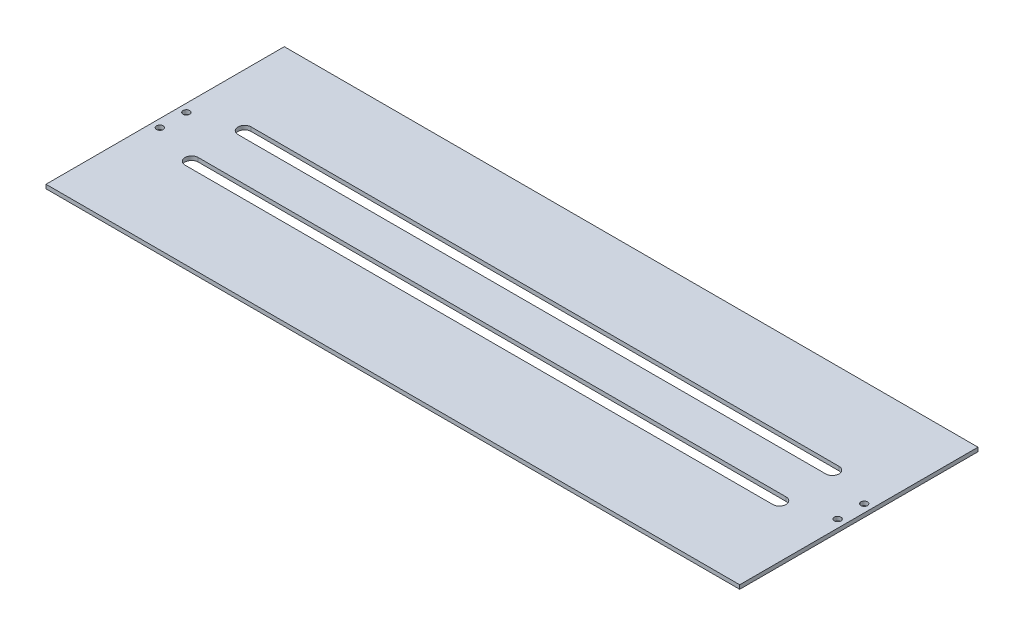
ISO-10303-21;
HEADER;
FILE_DESCRIPTION(('STEP AP214'),'2;1');
FILE_NAME('part.step','',(''),(''),'','','');
FILE_SCHEMA(('AUTOMOTIVE_DESIGN { 1 0 10303 214 1 1 1 1 }'));
ENDSEC;
DATA;
#1=APPLICATION_CONTEXT('core data for automotive mechanical design processes');
#2=APPLICATION_PROTOCOL_DEFINITION('international standard','automotive_design',2000,#1);
#3=PRODUCT_CONTEXT('',#1,'mechanical');
#4=PRODUCT('Part','Part','',(#3));
#5=PRODUCT_RELATED_PRODUCT_CATEGORY('part','',(#4));
#6=PRODUCT_DEFINITION_FORMATION('','',#4);
#7=PRODUCT_DEFINITION_CONTEXT('part definition',#1,'design');
#8=PRODUCT_DEFINITION('design','',#6,#7);
#9=PRODUCT_DEFINITION_SHAPE('','',#8);
#10=(LENGTH_UNIT() NAMED_UNIT(*) SI_UNIT(.MILLI.,.METRE.));
#11=(NAMED_UNIT(*) PLANE_ANGLE_UNIT() SI_UNIT($,.RADIAN.));
#12=(NAMED_UNIT(*) SI_UNIT($,.STERADIAN.) SOLID_ANGLE_UNIT());
#13=UNCERTAINTY_MEASURE_WITH_UNIT(LENGTH_MEASURE(1.E-05),#10,'distance_accuracy_value','');
#14=(GEOMETRIC_REPRESENTATION_CONTEXT(3) GLOBAL_UNCERTAINTY_ASSIGNED_CONTEXT((#13)) GLOBAL_UNIT_ASSIGNED_CONTEXT((#10,
#11,#12)) REPRESENTATION_CONTEXT('',''));
#15=CARTESIAN_POINT('',(0.,0.,0.));
#16=DIRECTION('',(0.,0.,1.));
#17=DIRECTION('',(1.,0.,0.));
#18=AXIS2_PLACEMENT_3D('',#15,#16,#17);
#19=CARTESIAN_POINT('',(0.,3.,0.));
#20=DIRECTION('',(0.,-1.,0.));
#21=DIRECTION('',(0.,0.,-1.));
#22=AXIS2_PLACEMENT_3D('',#19,#20,#21);
#23=PLANE('',#22);
#24=CARTESIAN_POINT('',(518.,3.,-100.));
#25=DIRECTION('',(0.,1.,0.));
#26=DIRECTION('',(0.,0.,-1.));
#27=AXIS2_PLACEMENT_3D('',#24,#25,#26);
#28=CIRCLE('',#27,2.50000000000002);
#29=CARTESIAN_POINT('',(518.,3.,-102.5));
#30=VERTEX_POINT('',#29);
#31=EDGE_CURVE('E405',#30,#30,#28,.T.);
#32=ORIENTED_EDGE('',*,*,#31,.F.);
#33=EDGE_LOOP('',(#32));
#34=FACE_BOUND('',#33,.T.);
#35=CARTESIAN_POINT('',(6.,3.,-100.));
#36=DIRECTION('',(0.,1.,0.));
#37=DIRECTION('',(0.,0.,1.));
#38=AXIS2_PLACEMENT_3D('',#35,#36,#37);
#39=CIRCLE('',#38,2.5);
#40=CARTESIAN_POINT('',(6.,3.,-97.5));
#41=VERTEX_POINT('',#40);
#42=EDGE_CURVE('E153',#41,#41,#39,.T.);
#43=ORIENTED_EDGE('',*,*,#42,.F.);
#44=EDGE_LOOP('',(#43));
#45=FACE_BOUND('',#44,.T.);
#46=DIRECTION('',(1.,0.,0.));
#47=VECTOR('',#46,1.);
#48=CARTESIAN_POINT('',(0.,3.,-115.));
#49=LINE('',#48,#47);
#50=CARTESIAN_POINT('',(40.,3.,-115.));
#51=VERTEX_POINT('',#50);
#52=CARTESIAN_POINT('',(484.,3.,-115.));
#53=VERTEX_POINT('',#52);
#54=EDGE_CURVE('E136',#51,#53,#49,.T.);
#55=ORIENTED_EDGE('',*,*,#54,.T.);
#56=CARTESIAN_POINT('',(484.,3.,-110.));
#57=DIRECTION('',(0.,1.,0.));
#58=DIRECTION('',(0.,0.,1.));
#59=AXIS2_PLACEMENT_3D('',#56,#57,#58);
#60=CIRCLE('',#59,4.99999999999998);
#61=CARTESIAN_POINT('',(484.,3.,-105.));
#62=VERTEX_POINT('',#61);
#63=EDGE_CURVE('E131',#53,#62,#60,.F.);
#64=ORIENTED_EDGE('',*,*,#63,.T.);
#65=DIRECTION('',(1.,0.,0.));
#66=VECTOR('',#65,1.);
#67=CARTESIAN_POINT('',(0.,3.,-105.));
#68=LINE('',#67,#66);
#69=CARTESIAN_POINT('',(40.,3.,-105.));
#70=VERTEX_POINT('',#69);
#71=EDGE_CURVE('E123',#70,#62,#68,.T.);
#72=ORIENTED_EDGE('',*,*,#71,.F.);
#73=CARTESIAN_POINT('',(40.,3.,-110.));
#74=DIRECTION('',(0.,1.,0.));
#75=DIRECTION('',(0.,0.,1.));
#76=AXIS2_PLACEMENT_3D('',#73,#74,#75);
#77=CIRCLE('',#76,4.99999999999998);
#78=EDGE_CURVE('E50',#70,#51,#77,.F.);
#79=ORIENTED_EDGE('',*,*,#78,.T.);
#80=EDGE_LOOP('',(#55,#64,#72,#79));
#81=FACE_BOUND('',#80,.T.);
#82=CARTESIAN_POINT('',(518.,3.,-79.9999999999999));
#83=DIRECTION('',(0.,-1.,0.));
#84=DIRECTION('',(0.,0.,1.));
#85=AXIS2_PLACEMENT_3D('',#82,#83,#84);
#86=CIRCLE('',#85,2.50000000000002);
#87=CARTESIAN_POINT('',(518.,3.,-77.4999999999999));
#88=VERTEX_POINT('',#87);
#89=EDGE_CURVE('E163',#88,#88,#86,.T.);
#90=ORIENTED_EDGE('',*,*,#89,.T.);
#91=EDGE_LOOP('',(#90));
#92=FACE_BOUND('',#91,.T.);
#93=CARTESIAN_POINT('',(6.,3.,-80.));
#94=DIRECTION('',(0.,-1.,0.));
#95=DIRECTION('',(0.,0.,-1.));
#96=AXIS2_PLACEMENT_3D('',#93,#94,#95);
#97=CIRCLE('',#96,2.5);
#98=CARTESIAN_POINT('',(6.,3.,-82.5));
#99=VERTEX_POINT('',#98);
#100=EDGE_CURVE('E169',#99,#99,#97,.T.);
#101=ORIENTED_EDGE('',*,*,#100,.T.);
#102=EDGE_LOOP('',(#101));
#103=FACE_BOUND('',#102,.T.);
#104=DIRECTION('',(0.,0.,-1.));
#105=VECTOR('',#104,1.);
#106=CARTESIAN_POINT('',(0.,3.,0.));
#107=LINE('',#106,#105);
#108=CARTESIAN_POINT('',(0.,3.,0.));
#109=VERTEX_POINT('',#108);
#110=CARTESIAN_POINT('',(0.,3.,-180.));
#111=VERTEX_POINT('',#110);
#112=EDGE_CURVE('E206',#109,#111,#107,.T.);
#113=ORIENTED_EDGE('',*,*,#112,.F.);
#114=DIRECTION('',(1.,0.,0.));
#115=VECTOR('',#114,1.);
#116=CARTESIAN_POINT('',(0.,3.,0.));
#117=LINE('',#116,#115);
#118=CARTESIAN_POINT('',(524.,3.,0.));
#119=VERTEX_POINT('',#118);
#120=EDGE_CURVE('E215',#109,#119,#117,.T.);
#121=ORIENTED_EDGE('',*,*,#120,.T.);
#122=DIRECTION('',(0.,0.,-1.));
#123=VECTOR('',#122,1.);
#124=CARTESIAN_POINT('',(524.,3.,0.));
#125=LINE('',#124,#123);
#126=CARTESIAN_POINT('',(524.,3.,-180.));
#127=VERTEX_POINT('',#126);
#128=EDGE_CURVE('E213',#119,#127,#125,.T.);
#129=ORIENTED_EDGE('',*,*,#128,.T.);
#130=DIRECTION('',(1.,0.,0.));
#131=VECTOR('',#130,1.);
#132=CARTESIAN_POINT('',(0.,3.,-180.));
#133=LINE('',#132,#131);
#134=EDGE_CURVE('E209',#111,#127,#133,.T.);
#135=ORIENTED_EDGE('',*,*,#134,.F.);
#136=EDGE_LOOP('',(#113,#121,#129,#135));
#137=FACE_BOUND('',#136,.T.);
#138=CARTESIAN_POINT('',(484.,3.,-70.));
#139=DIRECTION('',(0.,-1.,0.));
#140=DIRECTION('',(0.,0.,-1.));
#141=AXIS2_PLACEMENT_3D('',#138,#139,#140);
#142=CIRCLE('',#141,4.99999999999998);
#143=CARTESIAN_POINT('',(484.,3.,-65.));
#144=VERTEX_POINT('',#143);
#145=CARTESIAN_POINT('',(484.,3.,-74.9999999999999));
#146=VERTEX_POINT('',#145);
#147=EDGE_CURVE('E175',#144,#146,#142,.F.);
#148=ORIENTED_EDGE('',*,*,#147,.F.);
#149=DIRECTION('',(1.,0.,0.));
#150=VECTOR('',#149,1.);
#151=CARTESIAN_POINT('',(0.,3.,-65.));
#152=LINE('',#151,#150);
#153=CARTESIAN_POINT('',(40.,3.,-65.));
#154=VERTEX_POINT('',#153);
#155=EDGE_CURVE('E177',#154,#144,#152,.T.);
#156=ORIENTED_EDGE('',*,*,#155,.F.);
#157=CARTESIAN_POINT('',(40.,3.,-70.));
#158=DIRECTION('',(0.,-1.,0.));
#159=DIRECTION('',(0.,0.,-1.));
#160=AXIS2_PLACEMENT_3D('',#157,#158,#159);
#161=CIRCLE('',#160,4.99999999999998);
#162=CARTESIAN_POINT('',(40.,3.,-74.9999999999999));
#163=VERTEX_POINT('',#162);
#164=EDGE_CURVE('E180',#163,#154,#161,.F.);
#165=ORIENTED_EDGE('',*,*,#164,.F.);
#166=DIRECTION('',(1.,0.,0.));
#167=VECTOR('',#166,1.);
#168=CARTESIAN_POINT('',(0.,3.,-74.9999999999999));
#169=LINE('',#168,#167);
#170=EDGE_CURVE('E183',#163,#146,#169,.T.);
#171=ORIENTED_EDGE('',*,*,#170,.T.);
#172=EDGE_LOOP('',(#148,#156,#165,#171));
#173=FACE_BOUND('',#172,.T.);
#174=ADVANCED_FACE('F33',(#34,#45,#81,#92,#103,#137,#173),#23,.F.);
#175=CARTESIAN_POINT('',(0.,0.,0.));
#176=DIRECTION('',(0.,-1.,0.));
#177=DIRECTION('',(0.,0.,-1.));
#178=AXIS2_PLACEMENT_3D('',#175,#176,#177);
#179=PLANE('',#178);
#180=CARTESIAN_POINT('',(518.,0.,-100.));
#181=DIRECTION('',(0.,1.,0.));
#182=DIRECTION('',(0.,0.,-1.));
#183=AXIS2_PLACEMENT_3D('',#180,#181,#182);
#184=CIRCLE('',#183,2.50000000000002);
#185=CARTESIAN_POINT('',(518.,0.,-102.5));
#186=VERTEX_POINT('',#185);
#187=EDGE_CURVE('E408',#186,#186,#184,.T.);
#188=ORIENTED_EDGE('',*,*,#187,.T.);
#189=EDGE_LOOP('',(#188));
#190=FACE_BOUND('',#189,.T.);
#191=CARTESIAN_POINT('',(6.,0.,-100.));
#192=DIRECTION('',(0.,1.,0.));
#193=DIRECTION('',(0.,0.,1.));
#194=AXIS2_PLACEMENT_3D('',#191,#192,#193);
#195=CIRCLE('',#194,2.5);
#196=CARTESIAN_POINT('',(6.,0.,-97.5));
#197=VERTEX_POINT('',#196);
#198=EDGE_CURVE('E146',#197,#197,#195,.T.);
#199=ORIENTED_EDGE('',*,*,#198,.T.);
#200=EDGE_LOOP('',(#199));
#201=FACE_BOUND('',#200,.T.);
#202=CARTESIAN_POINT('',(484.,0.,-110.));
#203=DIRECTION('',(0.,1.,0.));
#204=DIRECTION('',(0.,0.,1.));
#205=AXIS2_PLACEMENT_3D('',#202,#203,#204);
#206=CIRCLE('',#205,4.99999999999998);
#207=CARTESIAN_POINT('',(484.,0.,-115.));
#208=VERTEX_POINT('',#207);
#209=CARTESIAN_POINT('',(484.,0.,-105.));
#210=VERTEX_POINT('',#209);
#211=EDGE_CURVE('E58',#208,#210,#206,.F.);
#212=ORIENTED_EDGE('',*,*,#211,.F.);
#213=DIRECTION('',(1.,0.,0.));
#214=VECTOR('',#213,1.);
#215=CARTESIAN_POINT('',(0.,0.,-115.));
#216=LINE('',#215,#214);
#217=CARTESIAN_POINT('',(40.,0.,-115.));
#218=VERTEX_POINT('',#217);
#219=EDGE_CURVE('E140',#218,#208,#216,.T.);
#220=ORIENTED_EDGE('',*,*,#219,.F.);
#221=CARTESIAN_POINT('',(40.,0.,-110.));
#222=DIRECTION('',(0.,1.,0.));
#223=DIRECTION('',(0.,0.,1.));
#224=AXIS2_PLACEMENT_3D('',#221,#222,#223);
#225=CIRCLE('',#224,4.99999999999998);
#226=CARTESIAN_POINT('',(40.,0.,-105.));
#227=VERTEX_POINT('',#226);
#228=EDGE_CURVE('E143',#227,#218,#225,.F.);
#229=ORIENTED_EDGE('',*,*,#228,.F.);
#230=DIRECTION('',(1.,0.,0.));
#231=VECTOR('',#230,1.);
#232=CARTESIAN_POINT('',(0.,0.,-105.));
#233=LINE('',#232,#231);
#234=EDGE_CURVE('E152',#227,#210,#233,.T.);
#235=ORIENTED_EDGE('',*,*,#234,.T.);
#236=EDGE_LOOP('',(#212,#220,#229,#235));
#237=FACE_BOUND('',#236,.T.);
#238=CARTESIAN_POINT('',(518.,0.,-79.9999999999999));
#239=DIRECTION('',(0.,-1.,0.));
#240=DIRECTION('',(0.,0.,1.));
#241=AXIS2_PLACEMENT_3D('',#238,#239,#240);
#242=CIRCLE('',#241,2.50000000000002);
#243=CARTESIAN_POINT('',(518.,0.,-77.4999999999999));
#244=VERTEX_POINT('',#243);
#245=EDGE_CURVE('E159',#244,#244,#242,.T.);
#246=ORIENTED_EDGE('',*,*,#245,.F.);
#247=EDGE_LOOP('',(#246));
#248=FACE_BOUND('',#247,.T.);
#249=CARTESIAN_POINT('',(6.,0.,-80.));
#250=DIRECTION('',(0.,-1.,0.));
#251=DIRECTION('',(0.,0.,-1.));
#252=AXIS2_PLACEMENT_3D('',#249,#250,#251);
#253=CIRCLE('',#252,2.5);
#254=CARTESIAN_POINT('',(6.,0.,-82.5));
#255=VERTEX_POINT('',#254);
#256=EDGE_CURVE('E166',#255,#255,#253,.T.);
#257=ORIENTED_EDGE('',*,*,#256,.F.);
#258=EDGE_LOOP('',(#257));
#259=FACE_BOUND('',#258,.T.);
#260=DIRECTION('',(0.,0.,-1.));
#261=VECTOR('',#260,1.);
#262=CARTESIAN_POINT('',(0.,0.,0.));
#263=LINE('',#262,#261);
#264=CARTESIAN_POINT('',(0.,0.,0.));
#265=VERTEX_POINT('',#264);
#266=CARTESIAN_POINT('',(0.,0.,-180.));
#267=VERTEX_POINT('',#266);
#268=EDGE_CURVE('E199',#265,#267,#263,.T.);
#269=ORIENTED_EDGE('',*,*,#268,.T.);
#270=DIRECTION('',(1.,0.,0.));
#271=VECTOR('',#270,1.);
#272=CARTESIAN_POINT('',(0.,0.,-180.));
#273=LINE('',#272,#271);
#274=CARTESIAN_POINT('',(524.,0.,-180.));
#275=VERTEX_POINT('',#274);
#276=EDGE_CURVE('E219',#267,#275,#273,.T.);
#277=ORIENTED_EDGE('',*,*,#276,.T.);
#278=DIRECTION('',(0.,0.,-1.));
#279=VECTOR('',#278,1.);
#280=CARTESIAN_POINT('',(524.,0.,0.));
#281=LINE('',#280,#279);
#282=CARTESIAN_POINT('',(524.,0.,0.));
#283=VERTEX_POINT('',#282);
#284=EDGE_CURVE('E222',#283,#275,#281,.T.);
#285=ORIENTED_EDGE('',*,*,#284,.F.);
#286=DIRECTION('',(1.,0.,0.));
#287=VECTOR('',#286,1.);
#288=CARTESIAN_POINT('',(0.,0.,0.));
#289=LINE('',#288,#287);
#290=EDGE_CURVE('E210',#265,#283,#289,.T.);
#291=ORIENTED_EDGE('',*,*,#290,.F.);
#292=EDGE_LOOP('',(#269,#277,#285,#291));
#293=FACE_BOUND('',#292,.T.);
#294=DIRECTION('',(1.,0.,0.));
#295=VECTOR('',#294,1.);
#296=CARTESIAN_POINT('',(0.,0.,-65.));
#297=LINE('',#296,#295);
#298=CARTESIAN_POINT('',(40.,0.,-65.));
#299=VERTEX_POINT('',#298);
#300=CARTESIAN_POINT('',(484.,0.,-65.));
#301=VERTEX_POINT('',#300);
#302=EDGE_CURVE('E189',#299,#301,#297,.T.);
#303=ORIENTED_EDGE('',*,*,#302,.T.);
#304=CARTESIAN_POINT('',(484.,0.,-70.));
#305=DIRECTION('',(0.,-1.,0.));
#306=DIRECTION('',(0.,0.,-1.));
#307=AXIS2_PLACEMENT_3D('',#304,#305,#306);
#308=CIRCLE('',#307,4.99999999999998);
#309=CARTESIAN_POINT('',(484.,0.,-74.9999999999999));
#310=VERTEX_POINT('',#309);
#311=EDGE_CURVE('E172',#301,#310,#308,.F.);
#312=ORIENTED_EDGE('',*,*,#311,.T.);
#313=DIRECTION('',(1.,0.,0.));
#314=VECTOR('',#313,1.);
#315=CARTESIAN_POINT('',(0.,0.,-74.9999999999999));
#316=LINE('',#315,#314);
#317=CARTESIAN_POINT('',(40.,0.,-74.9999999999999));
#318=VERTEX_POINT('',#317);
#319=EDGE_CURVE('E178',#318,#310,#316,.T.);
#320=ORIENTED_EDGE('',*,*,#319,.F.);
#321=CARTESIAN_POINT('',(40.,0.,-70.));
#322=DIRECTION('',(0.,-1.,0.));
#323=DIRECTION('',(0.,0.,-1.));
#324=AXIS2_PLACEMENT_3D('',#321,#322,#323);
#325=CIRCLE('',#324,4.99999999999998);
#326=EDGE_CURVE('E192',#318,#299,#325,.F.);
#327=ORIENTED_EDGE('',*,*,#326,.T.);
#328=EDGE_LOOP('',(#303,#312,#320,#327));
#329=FACE_BOUND('',#328,.T.);
#330=ADVANCED_FACE('F239',(#190,#201,#237,#248,#259,#293,#329),#179,.T.);
#331=CARTESIAN_POINT('',(0.,3.,0.));
#332=DIRECTION('',(-1.,0.,0.));
#333=DIRECTION('',(0.,0.,1.));
#334=AXIS2_PLACEMENT_3D('',#331,#332,#333);
#335=PLANE('',#334);
#336=ORIENTED_EDGE('',*,*,#268,.F.);
#337=DIRECTION('',(0.,-1.,0.));
#338=VECTOR('',#337,1.);
#339=CARTESIAN_POINT('',(0.,3.,0.));
#340=LINE('',#339,#338);
#341=EDGE_CURVE('E11',#109,#265,#340,.T.);
#342=ORIENTED_EDGE('',*,*,#341,.F.);
#343=ORIENTED_EDGE('',*,*,#112,.T.);
#344=DIRECTION('',(0.,-1.,0.));
#345=VECTOR('',#344,1.);
#346=CARTESIAN_POINT('',(0.,3.,-180.));
#347=LINE('',#346,#345);
#348=EDGE_CURVE('E37',#111,#267,#347,.T.);
#349=ORIENTED_EDGE('',*,*,#348,.T.);
#350=EDGE_LOOP('',(#336,#342,#343,#349));
#351=FACE_BOUND('',#350,.T.);
#352=ADVANCED_FACE('F35',(#351),#335,.T.);
#353=CARTESIAN_POINT('',(0.,3.,0.));
#354=DIRECTION('',(0.,0.,-1.));
#355=DIRECTION('',(-1.,0.,0.));
#356=AXIS2_PLACEMENT_3D('',#353,#354,#355);
#357=PLANE('',#356);
#358=ORIENTED_EDGE('',*,*,#290,.T.);
#359=DIRECTION('',(0.,-1.,0.));
#360=VECTOR('',#359,1.);
#361=CARTESIAN_POINT('',(524.,3.,0.));
#362=LINE('',#361,#360);
#363=EDGE_CURVE('E42',#119,#283,#362,.T.);
#364=ORIENTED_EDGE('',*,*,#363,.F.);
#365=ORIENTED_EDGE('',*,*,#120,.F.);
#366=ORIENTED_EDGE('',*,*,#341,.T.);
#367=EDGE_LOOP('',(#358,#364,#365,#366));
#368=FACE_BOUND('',#367,.T.);
#369=ADVANCED_FACE('F243',(#368),#357,.F.);
#370=CARTESIAN_POINT('',(524.,3.,0.));
#371=DIRECTION('',(-1.,0.,0.));
#372=DIRECTION('',(0.,0.,1.));
#373=AXIS2_PLACEMENT_3D('',#370,#371,#372);
#374=PLANE('',#373);
#375=ORIENTED_EDGE('',*,*,#284,.T.);
#376=DIRECTION('',(0.,-1.,0.));
#377=VECTOR('',#376,1.);
#378=CARTESIAN_POINT('',(524.,3.,-180.));
#379=LINE('',#378,#377);
#380=EDGE_CURVE('E227',#127,#275,#379,.T.);
#381=ORIENTED_EDGE('',*,*,#380,.F.);
#382=ORIENTED_EDGE('',*,*,#128,.F.);
#383=ORIENTED_EDGE('',*,*,#363,.T.);
#384=EDGE_LOOP('',(#375,#381,#382,#383));
#385=FACE_BOUND('',#384,.T.);
#386=ADVANCED_FACE('F247',(#385),#374,.F.);
#387=CARTESIAN_POINT('',(0.,3.,-180.));
#388=DIRECTION('',(0.,0.,-1.));
#389=DIRECTION('',(-1.,0.,0.));
#390=AXIS2_PLACEMENT_3D('',#387,#388,#389);
#391=PLANE('',#390);
#392=ORIENTED_EDGE('',*,*,#276,.F.);
#393=ORIENTED_EDGE('',*,*,#348,.F.);
#394=ORIENTED_EDGE('',*,*,#134,.T.);
#395=ORIENTED_EDGE('',*,*,#380,.T.);
#396=EDGE_LOOP('',(#392,#393,#394,#395));
#397=FACE_BOUND('',#396,.T.);
#398=ADVANCED_FACE('F235',(#397),#391,.T.);
#399=CARTESIAN_POINT('',(484.,3.,-70.));
#400=DIRECTION('',(0.,-1.,0.));
#401=DIRECTION('',(0.,0.,-1.));
#402=AXIS2_PLACEMENT_3D('',#399,#400,#401);
#403=CYLINDRICAL_SURFACE('',#402,4.99999999999998);
#404=ORIENTED_EDGE('',*,*,#311,.F.);
#405=DIRECTION('',(0.,-1.,0.));
#406=VECTOR('',#405,1.);
#407=CARTESIAN_POINT('',(484.,3.,-65.));
#408=LINE('',#407,#406);
#409=EDGE_CURVE('E186',#144,#301,#408,.T.);
#410=ORIENTED_EDGE('',*,*,#409,.F.);
#411=ORIENTED_EDGE('',*,*,#147,.T.);
#412=DIRECTION('',(0.,-1.,0.));
#413=VECTOR('',#412,1.);
#414=CARTESIAN_POINT('',(484.,3.,-74.9999999999999));
#415=LINE('',#414,#413);
#416=EDGE_CURVE('E197',#146,#310,#415,.T.);
#417=ORIENTED_EDGE('',*,*,#416,.T.);
#418=EDGE_LOOP('',(#404,#410,#411,#417));
#419=FACE_BOUND('',#418,.T.);
#420=ADVANCED_FACE('F260',(#419),#403,.F.);
#421=CARTESIAN_POINT('',(0.,3.,-74.9999999999999));
#422=DIRECTION('',(0.,0.,-1.));
#423=DIRECTION('',(-1.,0.,0.));
#424=AXIS2_PLACEMENT_3D('',#421,#422,#423);
#425=PLANE('',#424);
#426=ORIENTED_EDGE('',*,*,#319,.T.);
#427=ORIENTED_EDGE('',*,*,#416,.F.);
#428=ORIENTED_EDGE('',*,*,#170,.F.);
#429=DIRECTION('',(0.,-1.,0.));
#430=VECTOR('',#429,1.);
#431=CARTESIAN_POINT('',(40.,3.,-74.9999999999999));
#432=LINE('',#431,#430);
#433=EDGE_CURVE('E200',#163,#318,#432,.T.);
#434=ORIENTED_EDGE('',*,*,#433,.T.);
#435=EDGE_LOOP('',(#426,#427,#428,#434));
#436=FACE_BOUND('',#435,.T.);
#437=ADVANCED_FACE('F262',(#436),#425,.F.);
#438=CARTESIAN_POINT('',(40.,3.,-70.));
#439=DIRECTION('',(0.,-1.,0.));
#440=DIRECTION('',(0.,0.,-1.));
#441=AXIS2_PLACEMENT_3D('',#438,#439,#440);
#442=CYLINDRICAL_SURFACE('',#441,4.99999999999998);
#443=ORIENTED_EDGE('',*,*,#326,.F.);
#444=ORIENTED_EDGE('',*,*,#433,.F.);
#445=ORIENTED_EDGE('',*,*,#164,.T.);
#446=DIRECTION('',(0.,-1.,0.));
#447=VECTOR('',#446,1.);
#448=CARTESIAN_POINT('',(40.,3.,-65.));
#449=LINE('',#448,#447);
#450=EDGE_CURVE('E202',#154,#299,#449,.T.);
#451=ORIENTED_EDGE('',*,*,#450,.T.);
#452=EDGE_LOOP('',(#443,#444,#445,#451));
#453=FACE_BOUND('',#452,.T.);
#454=ADVANCED_FACE('F269',(#453),#442,.F.);
#455=CARTESIAN_POINT('',(0.,3.,-65.));
#456=DIRECTION('',(0.,0.,-1.));
#457=DIRECTION('',(-1.,0.,0.));
#458=AXIS2_PLACEMENT_3D('',#455,#456,#457);
#459=PLANE('',#458);
#460=ORIENTED_EDGE('',*,*,#302,.F.);
#461=ORIENTED_EDGE('',*,*,#450,.F.);
#462=ORIENTED_EDGE('',*,*,#155,.T.);
#463=ORIENTED_EDGE('',*,*,#409,.T.);
#464=EDGE_LOOP('',(#460,#461,#462,#463));
#465=FACE_BOUND('',#464,.T.);
#466=ADVANCED_FACE('F267',(#465),#459,.T.);
#467=CARTESIAN_POINT('',(6.,3.,-80.));
#468=DIRECTION('',(0.,-1.,0.));
#469=DIRECTION('',(0.,0.,-1.));
#470=AXIS2_PLACEMENT_3D('',#467,#468,#469);
#471=CYLINDRICAL_SURFACE('',#470,2.5);
#472=ORIENTED_EDGE('',*,*,#100,.F.);
#473=EDGE_LOOP('',(#472));
#474=FACE_BOUND('',#473,.T.);
#475=ORIENTED_EDGE('',*,*,#256,.T.);
#476=EDGE_LOOP('',(#475));
#477=FACE_BOUND('',#476,.T.);
#478=ADVANCED_FACE('F276',(#474,#477),#471,.F.);
#479=CARTESIAN_POINT('',(518.,3.,-79.9999999999999));
#480=DIRECTION('',(0.,-1.,0.));
#481=DIRECTION('',(0.,0.,-1.));
#482=AXIS2_PLACEMENT_3D('',#479,#480,#481);
#483=CYLINDRICAL_SURFACE('',#482,2.50000000000002);
#484=ORIENTED_EDGE('',*,*,#89,.F.);
#485=EDGE_LOOP('',(#484));
#486=FACE_BOUND('',#485,.T.);
#487=ORIENTED_EDGE('',*,*,#245,.T.);
#488=EDGE_LOOP('',(#487));
#489=FACE_BOUND('',#488,.T.);
#490=ADVANCED_FACE('F321',(#486,#489),#483,.F.);
#491=CARTESIAN_POINT('',(484.,3.,-110.));
#492=DIRECTION('',(0.,-1.,0.));
#493=DIRECTION('',(0.,0.,-1.));
#494=AXIS2_PLACEMENT_3D('',#491,#492,#493);
#495=CYLINDRICAL_SURFACE('',#494,4.99999999999998);
#496=ORIENTED_EDGE('',*,*,#211,.T.);
#497=DIRECTION('',(0.,-1.,0.));
#498=VECTOR('',#497,1.);
#499=CARTESIAN_POINT('',(484.,3.,-105.));
#500=LINE('',#499,#498);
#501=EDGE_CURVE('E126',#62,#210,#500,.T.);
#502=ORIENTED_EDGE('',*,*,#501,.F.);
#503=ORIENTED_EDGE('',*,*,#63,.F.);
#504=DIRECTION('',(0.,-1.,0.));
#505=VECTOR('',#504,1.);
#506=CARTESIAN_POINT('',(484.,3.,-115.));
#507=LINE('',#506,#505);
#508=EDGE_CURVE('E157',#53,#208,#507,.T.);
#509=ORIENTED_EDGE('',*,*,#508,.T.);
#510=EDGE_LOOP('',(#496,#502,#503,#509));
#511=FACE_BOUND('',#510,.T.);
#512=ADVANCED_FACE('F134',(#511),#495,.F.);
#513=CARTESIAN_POINT('',(0.,3.,-115.));
#514=DIRECTION('',(0.,0.,-1.));
#515=DIRECTION('',(-1.,0.,0.));
#516=AXIS2_PLACEMENT_3D('',#513,#514,#515);
#517=PLANE('',#516);
#518=ORIENTED_EDGE('',*,*,#219,.T.);
#519=ORIENTED_EDGE('',*,*,#508,.F.);
#520=ORIENTED_EDGE('',*,*,#54,.F.);
#521=DIRECTION('',(0.,-1.,0.));
#522=VECTOR('',#521,1.);
#523=CARTESIAN_POINT('',(40.,3.,-115.));
#524=LINE('',#523,#522);
#525=EDGE_CURVE('E160',#51,#218,#524,.T.);
#526=ORIENTED_EDGE('',*,*,#525,.T.);
#527=EDGE_LOOP('',(#518,#519,#520,#526));
#528=FACE_BOUND('',#527,.T.);
#529=ADVANCED_FACE('F352',(#528),#517,.F.);
#530=CARTESIAN_POINT('',(40.,3.,-110.));
#531=DIRECTION('',(0.,-1.,0.));
#532=DIRECTION('',(0.,0.,-1.));
#533=AXIS2_PLACEMENT_3D('',#530,#531,#532);
#534=CYLINDRICAL_SURFACE('',#533,4.99999999999998);
#535=ORIENTED_EDGE('',*,*,#228,.T.);
#536=ORIENTED_EDGE('',*,*,#525,.F.);
#537=ORIENTED_EDGE('',*,*,#78,.F.);
#538=DIRECTION('',(0.,-1.,0.));
#539=VECTOR('',#538,1.);
#540=CARTESIAN_POINT('',(40.,3.,-105.));
#541=LINE('',#540,#539);
#542=EDGE_CURVE('E128',#70,#227,#541,.T.);
#543=ORIENTED_EDGE('',*,*,#542,.T.);
#544=EDGE_LOOP('',(#535,#536,#537,#543));
#545=FACE_BOUND('',#544,.T.);
#546=ADVANCED_FACE('F361',(#545),#534,.F.);
#547=CARTESIAN_POINT('',(0.,3.,-105.));
#548=DIRECTION('',(0.,0.,-1.));
#549=DIRECTION('',(-1.,0.,0.));
#550=AXIS2_PLACEMENT_3D('',#547,#548,#549);
#551=PLANE('',#550);
#552=ORIENTED_EDGE('',*,*,#234,.F.);
#553=ORIENTED_EDGE('',*,*,#542,.F.);
#554=ORIENTED_EDGE('',*,*,#71,.T.);
#555=ORIENTED_EDGE('',*,*,#501,.T.);
#556=EDGE_LOOP('',(#552,#553,#554,#555));
#557=FACE_BOUND('',#556,.T.);
#558=ADVANCED_FACE('F125',(#557),#551,.T.);
#559=CARTESIAN_POINT('',(6.,3.,-100.));
#560=DIRECTION('',(0.,-1.,0.));
#561=DIRECTION('',(0.,0.,-1.));
#562=AXIS2_PLACEMENT_3D('',#559,#560,#561);
#563=CYLINDRICAL_SURFACE('',#562,2.5);
#564=ORIENTED_EDGE('',*,*,#42,.T.);
#565=EDGE_LOOP('',(#564));
#566=FACE_BOUND('',#565,.T.);
#567=ORIENTED_EDGE('',*,*,#198,.F.);
#568=EDGE_LOOP('',(#567));
#569=FACE_BOUND('',#568,.T.);
#570=ADVANCED_FACE('F379',(#566,#569),#563,.F.);
#571=CARTESIAN_POINT('',(518.,3.,-100.));
#572=DIRECTION('',(0.,-1.,0.));
#573=DIRECTION('',(0.,0.,-1.));
#574=AXIS2_PLACEMENT_3D('',#571,#572,#573);
#575=CYLINDRICAL_SURFACE('',#574,2.50000000000002);
#576=ORIENTED_EDGE('',*,*,#31,.T.);
#577=EDGE_LOOP('',(#576));
#578=FACE_BOUND('',#577,.T.);
#579=ORIENTED_EDGE('',*,*,#187,.F.);
#580=EDGE_LOOP('',(#579));
#581=FACE_BOUND('',#580,.T.);
#582=ADVANCED_FACE('F388',(#578,#581),#575,.F.);
#583=CLOSED_SHELL('',(#174,#330,#352,#369,#386,#398,#420,#437,#454,#466,#478,#490,#512,#529,
#546,#558,#570,#582));
#584=MANIFOLD_SOLID_BREP('B2',#583);
#585=ADVANCED_BREP_SHAPE_REPRESENTATION('',(#18,#584),#14);
#586=SHAPE_DEFINITION_REPRESENTATION(#9,#585);
ENDSEC;
END-ISO-10303-21;
